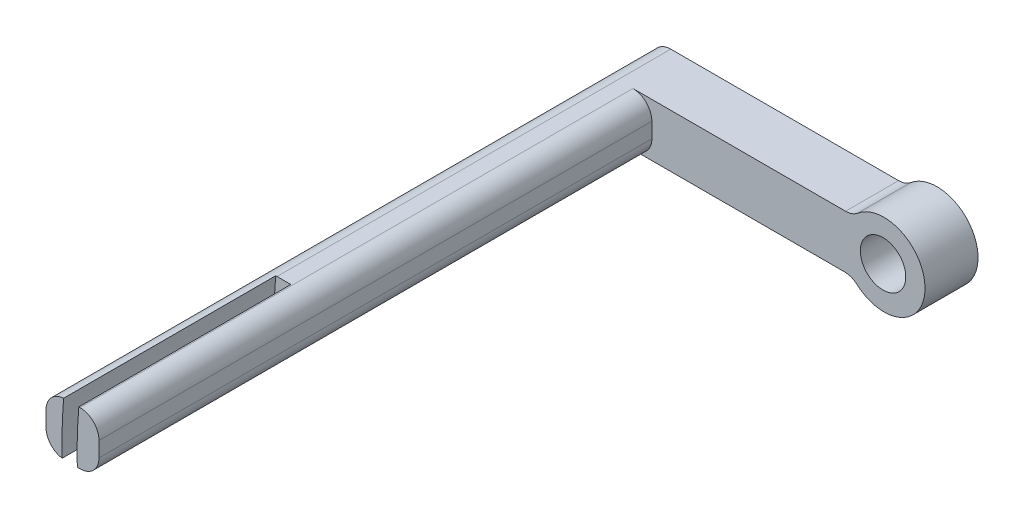
ISO-10303-21;
HEADER;
FILE_DESCRIPTION(('STEP AP214'),'2;1');
FILE_NAME('part.step','',(''),(''),'','','');
FILE_SCHEMA(('AUTOMOTIVE_DESIGN { 1 0 10303 214 1 1 1 1 }'));
ENDSEC;
DATA;
#1=APPLICATION_CONTEXT('core data for automotive mechanical design processes');
#2=APPLICATION_PROTOCOL_DEFINITION('international standard','automotive_design',2000,#1);
#3=PRODUCT_CONTEXT('',#1,'mechanical');
#4=PRODUCT('Part','Part','',(#3));
#5=PRODUCT_RELATED_PRODUCT_CATEGORY('part','',(#4));
#6=PRODUCT_DEFINITION_FORMATION('','',#4);
#7=PRODUCT_DEFINITION_CONTEXT('part definition',#1,'design');
#8=PRODUCT_DEFINITION('design','',#6,#7);
#9=PRODUCT_DEFINITION_SHAPE('','',#8);
#10=(LENGTH_UNIT() NAMED_UNIT(*) SI_UNIT(.MILLI.,.METRE.));
#11=(NAMED_UNIT(*) PLANE_ANGLE_UNIT() SI_UNIT($,.RADIAN.));
#12=(NAMED_UNIT(*) SI_UNIT($,.STERADIAN.) SOLID_ANGLE_UNIT());
#13=UNCERTAINTY_MEASURE_WITH_UNIT(LENGTH_MEASURE(1.E-05),#10,'distance_accuracy_value','');
#14=(GEOMETRIC_REPRESENTATION_CONTEXT(3) GLOBAL_UNCERTAINTY_ASSIGNED_CONTEXT((#13)) GLOBAL_UNIT_ASSIGNED_CONTEXT((#10,
#11,#12)) REPRESENTATION_CONTEXT('',''));
#15=CARTESIAN_POINT('',(0.,0.,0.));
#16=DIRECTION('',(0.,0.,1.));
#17=DIRECTION('',(1.,0.,0.));
#18=AXIS2_PLACEMENT_3D('',#15,#16,#17);
#19=CARTESIAN_POINT('',(-6.29725614319705,7.,24.804571616053));
#20=DIRECTION('',(0.,0.,-1.));
#21=DIRECTION('',(-1.,0.,0.));
#22=AXIS2_PLACEMENT_3D('',#19,#20,#21);
#23=PLANE('',#22);
#24=CARTESIAN_POINT('',(58.8086487792216,1.74301589662031,24.804571616053));
#25=DIRECTION('',(0.,0.,1.));
#26=DIRECTION('',(1.,0.,0.));
#27=AXIS2_PLACEMENT_3D('',#24,#25,#26);
#28=CIRCLE('',#27,61.);
#29=CARTESIAN_POINT('',(-1.96440543180858,7.,24.804571616053));
#30=VERTEX_POINT('',#29);
#31=CARTESIAN_POINT('',(-2.16644364042241,0.,24.804571616053));
#32=VERTEX_POINT('',#31);
#33=EDGE_CURVE('E151',#30,#32,#28,.T.);
#34=ORIENTED_EDGE('',*,*,#33,.T.);
#35=DIRECTION('',(1.,0.,0.));
#36=VECTOR('',#35,1.);
#37=CARTESIAN_POINT('',(-6.29725614319705,0.,24.804571616053));
#38=LINE('',#37,#36);
#39=CARTESIAN_POINT('',(-1.79725614319705,0.,24.804571616053));
#40=VERTEX_POINT('',#39);
#41=EDGE_CURVE('E202',#32,#40,#38,.T.);
#42=ORIENTED_EDGE('',*,*,#41,.T.);
#43=CARTESIAN_POINT('',(-1.79725614319705,2.5,24.8045716160531));
#44=DIRECTION('',(0.,0.,-1.));
#45=DIRECTION('',(-1.,0.,0.));
#46=AXIS2_PLACEMENT_3D('',#43,#44,#45);
#47=CIRCLE('',#46,2.5);
#48=CARTESIAN_POINT('',(0.70274385680295,2.5,24.804571616053));
#49=VERTEX_POINT('',#48);
#50=EDGE_CURVE('E239',#40,#49,#47,.F.);
#51=ORIENTED_EDGE('',*,*,#50,.T.);
#52=DIRECTION('',(0.,-1.,0.));
#53=VECTOR('',#52,1.);
#54=CARTESIAN_POINT('',(0.70274385680295,7.,24.804571616053));
#55=LINE('',#54,#53);
#56=CARTESIAN_POINT('',(0.70274385680295,4.5,24.804571616053));
#57=VERTEX_POINT('',#56);
#58=EDGE_CURVE('E181',#57,#49,#55,.T.);
#59=ORIENTED_EDGE('',*,*,#58,.F.);
#60=CARTESIAN_POINT('',(-1.79725614319705,4.5,24.804571616053));
#61=DIRECTION('',(0.,0.,-1.));
#62=DIRECTION('',(-1.,0.,0.));
#63=AXIS2_PLACEMENT_3D('',#60,#61,#62);
#64=CIRCLE('',#63,2.5);
#65=CARTESIAN_POINT('',(-1.79725614319705,7.,24.804571616053));
#66=VERTEX_POINT('',#65);
#67=EDGE_CURVE('E178',#57,#66,#64,.F.);
#68=ORIENTED_EDGE('',*,*,#67,.T.);
#69=DIRECTION('',(1.,0.,0.));
#70=VECTOR('',#69,1.);
#71=CARTESIAN_POINT('',(-6.29725614319705,7.,24.804571616053));
#72=LINE('',#71,#70);
#73=EDGE_CURVE('E169',#30,#66,#72,.T.);
#74=ORIENTED_EDGE('',*,*,#73,.F.);
#75=EDGE_LOOP('',(#34,#42,#51,#59,#68,#74));
#76=FACE_BOUND('',#75,.T.);
#77=ADVANCED_FACE('F39',(#76),#23,.F.);
#78=CARTESIAN_POINT('',(0.,7.,0.));
#79=DIRECTION('',(0.,1.,0.));
#80=DIRECTION('',(0.,0.,1.));
#81=AXIS2_PLACEMENT_3D('',#78,#79,#80);
#82=PLANE('',#81);
#83=DIRECTION('',(0.,0.,1.));
#84=VECTOR('',#83,1.);
#85=CARTESIAN_POINT('',(-3.79725614319705,7.,24.804571616053));
#86=LINE('',#85,#84);
#87=CARTESIAN_POINT('',(-3.79725614319706,7.,-55.195428383947));
#88=VERTEX_POINT('',#87);
#89=CARTESIAN_POINT('',(-3.79725614319705,7.,-3.19542838394696));
#90=VERTEX_POINT('',#89);
#91=EDGE_CURVE('E242',#88,#90,#86,.T.);
#92=ORIENTED_EDGE('',*,*,#91,.T.);
#93=DIRECTION('',(1.,0.,0.));
#94=VECTOR('',#93,1.);
#95=CARTESIAN_POINT('',(0.,7.,-3.19542838394696));
#96=LINE('',#95,#94);
#97=CARTESIAN_POINT('',(-1.96440543180858,7.,-3.19542838394696));
#98=VERTEX_POINT('',#97);
#99=EDGE_CURVE('E171',#90,#98,#96,.T.);
#100=ORIENTED_EDGE('',*,*,#99,.T.);
#101=DIRECTION('',(0.,0.,1.));
#102=VECTOR('',#101,1.);
#103=CARTESIAN_POINT('',(-1.96440543180858,7.,-3.19542838394696));
#104=LINE('',#103,#102);
#105=EDGE_CURVE('E155',#98,#30,#104,.T.);
#106=ORIENTED_EDGE('',*,*,#105,.T.);
#107=ORIENTED_EDGE('',*,*,#73,.T.);
#108=DIRECTION('',(0.,0.,-1.));
#109=VECTOR('',#108,1.);
#110=CARTESIAN_POINT('',(-1.79725614319706,7.,-48.195428383947));
#111=LINE('',#110,#109);
#112=CARTESIAN_POINT('',(-1.79725614319706,7.,-48.195428383947));
#113=VERTEX_POINT('',#112);
#114=EDGE_CURVE('E245',#66,#113,#111,.T.);
#115=ORIENTED_EDGE('',*,*,#114,.T.);
#116=DIRECTION('',(1.,0.,0.));
#117=VECTOR('',#116,1.);
#118=CARTESIAN_POINT('',(0.702743856802941,7.,-48.195428383947));
#119=LINE('',#118,#117);
#120=CARTESIAN_POINT('',(26.2839027131114,7.,-48.195428383947));
#121=VERTEX_POINT('',#120);
#122=EDGE_CURVE('E189',#113,#121,#119,.T.);
#123=ORIENTED_EDGE('',*,*,#122,.T.);
#124=DIRECTION('',(0.,0.,1.));
#125=VECTOR('',#124,1.);
#126=CARTESIAN_POINT('',(26.2839027131114,7.,-55.195428383947));
#127=LINE('',#126,#125);
#128=CARTESIAN_POINT('',(26.2839027131114,7.,-55.195428383947));
#129=VERTEX_POINT('',#128);
#130=EDGE_CURVE('E280',#121,#129,#127,.F.);
#131=ORIENTED_EDGE('',*,*,#130,.T.);
#132=DIRECTION('',(-1.,0.,0.));
#133=VECTOR('',#132,1.);
#134=CARTESIAN_POINT('',(0.702743856802941,7.,-55.195428383947));
#135=LINE('',#134,#133);
#136=EDGE_CURVE('E182',#129,#88,#135,.T.);
#137=ORIENTED_EDGE('',*,*,#136,.T.);
#138=EDGE_LOOP('',(#92,#100,#106,#107,#115,#123,#131,#137));
#139=FACE_BOUND('',#138,.T.);
#140=ADVANCED_FACE('F167',(#139),#82,.T.);
#141=CARTESIAN_POINT('',(0.,0.,0.));
#142=DIRECTION('',(0.,1.,0.));
#143=DIRECTION('',(0.,0.,1.));
#144=AXIS2_PLACEMENT_3D('',#141,#142,#143);
#145=PLANE('',#144);
#146=DIRECTION('',(1.,0.,0.));
#147=VECTOR('',#146,1.);
#148=CARTESIAN_POINT('',(0.,0.,-3.19542838394696));
#149=LINE('',#148,#147);
#150=CARTESIAN_POINT('',(-3.79725614319705,0.,-3.19542838394696));
#151=VERTEX_POINT('',#150);
#152=CARTESIAN_POINT('',(-2.16644364042241,0.,-3.19542838394696));
#153=VERTEX_POINT('',#152);
#154=EDGE_CURVE('E310',#151,#153,#149,.T.);
#155=ORIENTED_EDGE('',*,*,#154,.F.);
#156=DIRECTION('',(0.,0.,1.));
#157=VECTOR('',#156,1.);
#158=CARTESIAN_POINT('',(-3.79725614319705,0.,0.));
#159=LINE('',#158,#157);
#160=CARTESIAN_POINT('',(-3.79725614319706,0.,-55.195428383947));
#161=VERTEX_POINT('',#160);
#162=EDGE_CURVE('E223',#151,#161,#159,.F.);
#163=ORIENTED_EDGE('',*,*,#162,.T.);
#164=DIRECTION('',(-1.,0.,0.));
#165=VECTOR('',#164,1.);
#166=CARTESIAN_POINT('',(-6.29725614319706,0.,-55.195428383947));
#167=LINE('',#166,#165);
#168=CARTESIAN_POINT('',(26.133021239426,0.,-55.195428383947));
#169=VERTEX_POINT('',#168);
#170=EDGE_CURVE('E197',#169,#161,#167,.T.);
#171=ORIENTED_EDGE('',*,*,#170,.F.);
#172=DIRECTION('',(0.,0.,-1.));
#173=VECTOR('',#172,1.);
#174=CARTESIAN_POINT('',(26.133021239426,0.,0.));
#175=LINE('',#174,#173);
#176=CARTESIAN_POINT('',(26.133021239426,0.,-48.195428383947));
#177=VERTEX_POINT('',#176);
#178=EDGE_CURVE('E269',#169,#177,#175,.F.);
#179=ORIENTED_EDGE('',*,*,#178,.T.);
#180=DIRECTION('',(1.,0.,0.));
#181=VECTOR('',#180,1.);
#182=CARTESIAN_POINT('',(0.702743856802941,0.,-48.195428383947));
#183=LINE('',#182,#181);
#184=CARTESIAN_POINT('',(-1.79725614319706,0.,-48.195428383947));
#185=VERTEX_POINT('',#184);
#186=EDGE_CURVE('E193',#185,#177,#183,.T.);
#187=ORIENTED_EDGE('',*,*,#186,.F.);
#188=DIRECTION('',(0.,0.,-1.));
#189=VECTOR('',#188,1.);
#190=CARTESIAN_POINT('',(-1.79725614319705,0.,0.));
#191=LINE('',#190,#189);
#192=EDGE_CURVE('E226',#185,#40,#191,.F.);
#193=ORIENTED_EDGE('',*,*,#192,.T.);
#194=ORIENTED_EDGE('',*,*,#41,.F.);
#195=DIRECTION('',(0.,0.,1.));
#196=VECTOR('',#195,1.);
#197=CARTESIAN_POINT('',(-2.16644364042241,0.,-3.19542838394696));
#198=LINE('',#197,#196);
#199=EDGE_CURVE('E11',#153,#32,#198,.T.);
#200=ORIENTED_EDGE('',*,*,#199,.F.);
#201=EDGE_LOOP('',(#155,#163,#171,#179,#187,#193,#194,#200));
#202=FACE_BOUND('',#201,.T.);
#203=ADVANCED_FACE('F312',(#202),#145,.F.);
#204=CARTESIAN_POINT('',(0.702743856802941,7.,-48.195428383947));
#205=DIRECTION('',(-1.,0.,0.));
#206=DIRECTION('',(0.,0.,1.));
#207=AXIS2_PLACEMENT_3D('',#204,#205,#206);
#208=PLANE('',#207);
#209=ORIENTED_EDGE('',*,*,#58,.T.);
#210=DIRECTION('',(0.,0.,-1.));
#211=VECTOR('',#210,1.);
#212=CARTESIAN_POINT('',(0.702743856802941,2.5,-48.195428383947));
#213=LINE('',#212,#211);
#214=CARTESIAN_POINT('',(0.702743856802941,2.5,-48.195428383947));
#215=VERTEX_POINT('',#214);
#216=EDGE_CURVE('E219',#49,#215,#213,.T.);
#217=ORIENTED_EDGE('',*,*,#216,.T.);
#218=DIRECTION('',(0.,-1.,0.));
#219=VECTOR('',#218,1.);
#220=CARTESIAN_POINT('',(0.702743856802941,7.,-48.195428383947));
#221=LINE('',#220,#219);
#222=CARTESIAN_POINT('',(0.702743856802941,4.5,-48.195428383947));
#223=VERTEX_POINT('',#222);
#224=EDGE_CURVE('E212',#223,#215,#221,.T.);
#225=ORIENTED_EDGE('',*,*,#224,.F.);
#226=DIRECTION('',(0.,0.,-1.));
#227=VECTOR('',#226,1.);
#228=CARTESIAN_POINT('',(0.70274385680295,4.5,24.804571616053));
#229=LINE('',#228,#227);
#230=EDGE_CURVE('E216',#223,#57,#229,.F.);
#231=ORIENTED_EDGE('',*,*,#230,.T.);
#232=EDGE_LOOP('',(#209,#217,#225,#231));
#233=FACE_BOUND('',#232,.T.);
#234=ADVANCED_FACE('F366',(#233),#208,.F.);
#235=CARTESIAN_POINT('',(0.702743856802941,7.,-48.195428383947));
#236=DIRECTION('',(0.,0.,-1.));
#237=DIRECTION('',(-1.,0.,0.));
#238=AXIS2_PLACEMENT_3D('',#235,#236,#237);
#239=PLANE('',#238);
#240=CARTESIAN_POINT('',(31.2298948954184,3.46051657925337,-48.195428383947));
#241=DIRECTION('',(0.,0.,-1.));
#242=DIRECTION('',(-1.,0.,0.));
#243=AXIS2_PLACEMENT_3D('',#240,#241,#242);
#244=CIRCLE('',#243,3.);
#245=CARTESIAN_POINT('',(28.2298948954184,3.46051657925337,-48.195428383947));
#246=VERTEX_POINT('',#245);
#247=EDGE_CURVE('E331',#246,#246,#244,.T.);
#248=ORIENTED_EDGE('',*,*,#247,.T.);
#249=EDGE_LOOP('',(#248));
#250=FACE_BOUND('',#249,.T.);
#251=ORIENTED_EDGE('',*,*,#186,.T.);
#252=CARTESIAN_POINT('',(26.133021239426,-2.5,-48.195428383947));
#253=DIRECTION('',(0.,0.,-1.));
#254=DIRECTION('',(-1.,0.,0.));
#255=AXIS2_PLACEMENT_3D('',#252,#253,#254);
#256=CIRCLE('',#255,2.5);
#257=CARTESIAN_POINT('',(27.7857974676817,-0.624278608291504,-48.195428383947));
#258=VERTEX_POINT('',#257);
#259=EDGE_CURVE('E283',#177,#258,#256,.T.);
#260=ORIENTED_EDGE('',*,*,#259,.T.);
#261=CARTESIAN_POINT('',(31.3627665763609,3.43519257717622,-48.195428383947));
#262=DIRECTION('',(0.,0.,-1.));
#263=DIRECTION('',(-1.,0.,0.));
#264=AXIS2_PLACEMENT_3D('',#261,#262,#263);
#265=CIRCLE('',#264,5.41054658145439);
#266=CARTESIAN_POINT('',(27.8889952977239,7.58331593766156,-48.195428383947));
#267=VERTEX_POINT('',#266);
#268=EDGE_CURVE('E198',#267,#258,#265,.T.);
#269=ORIENTED_EDGE('',*,*,#268,.F.);
#270=CARTESIAN_POINT('',(26.2839027131114,9.5,-48.195428383947));
#271=DIRECTION('',(0.,0.,-1.));
#272=DIRECTION('',(-1.,0.,0.));
#273=AXIS2_PLACEMENT_3D('',#270,#271,#272);
#274=CIRCLE('',#273,2.5);
#275=EDGE_CURVE('E63',#267,#121,#274,.T.);
#276=ORIENTED_EDGE('',*,*,#275,.T.);
#277=ORIENTED_EDGE('',*,*,#122,.F.);
#278=CARTESIAN_POINT('',(-1.79725614319706,4.5,-48.195428383947));
#279=DIRECTION('',(0.,0.,-1.));
#280=DIRECTION('',(-1.,0.,0.));
#281=AXIS2_PLACEMENT_3D('',#278,#279,#280);
#282=CIRCLE('',#281,2.5);
#283=EDGE_CURVE('E266',#113,#223,#282,.T.);
#284=ORIENTED_EDGE('',*,*,#283,.T.);
#285=ORIENTED_EDGE('',*,*,#224,.T.);
#286=CARTESIAN_POINT('',(-1.79725614319706,2.5,-48.195428383947));
#287=DIRECTION('',(0.,0.,-1.));
#288=DIRECTION('',(-1.,0.,0.));
#289=AXIS2_PLACEMENT_3D('',#286,#287,#288);
#290=CIRCLE('',#289,2.5);
#291=EDGE_CURVE('E262',#215,#185,#290,.T.);
#292=ORIENTED_EDGE('',*,*,#291,.T.);
#293=EDGE_LOOP('',(#251,#260,#269,#276,#277,#284,#285,#292));
#294=FACE_BOUND('',#293,.T.);
#295=ADVANCED_FACE('F358',(#250,#294),#239,.F.);
#296=CARTESIAN_POINT('',(-6.29725614319706,7.,-55.195428383947));
#297=DIRECTION('',(0.,0.,1.));
#298=DIRECTION('',(1.,0.,0.));
#299=AXIS2_PLACEMENT_3D('',#296,#297,#298);
#300=PLANE('',#299);
#301=CARTESIAN_POINT('',(31.2298948954184,3.46051657925337,-55.195428383947));
#302=DIRECTION('',(0.,0.,-1.));
#303=DIRECTION('',(-1.,0.,0.));
#304=AXIS2_PLACEMENT_3D('',#301,#302,#303);
#305=CIRCLE('',#304,3.);
#306=CARTESIAN_POINT('',(28.2298948954184,3.46051657925337,-55.195428383947));
#307=VERTEX_POINT('',#306);
#308=EDGE_CURVE('E173',#307,#307,#305,.T.);
#309=ORIENTED_EDGE('',*,*,#308,.F.);
#310=EDGE_LOOP('',(#309));
#311=FACE_BOUND('',#310,.T.);
#312=ORIENTED_EDGE('',*,*,#136,.F.);
#313=CARTESIAN_POINT('',(26.2839027131114,9.5,-55.195428383947));
#314=DIRECTION('',(0.,0.,1.));
#315=DIRECTION('',(1.,0.,0.));
#316=AXIS2_PLACEMENT_3D('',#313,#314,#315);
#317=CIRCLE('',#316,2.5);
#318=CARTESIAN_POINT('',(27.8889952977239,7.58331593766156,-55.195428383947));
#319=VERTEX_POINT('',#318);
#320=EDGE_CURVE('E291',#129,#319,#317,.T.);
#321=ORIENTED_EDGE('',*,*,#320,.T.);
#322=CARTESIAN_POINT('',(31.3627665763609,3.43519257717622,-55.195428383947));
#323=DIRECTION('',(0.,0.,-1.));
#324=DIRECTION('',(-1.,0.,0.));
#325=AXIS2_PLACEMENT_3D('',#322,#323,#324);
#326=CIRCLE('',#325,5.41054658145439);
#327=CARTESIAN_POINT('',(27.7857974676817,-0.624278608291504,-55.195428383947));
#328=VERTEX_POINT('',#327);
#329=EDGE_CURVE('E335',#319,#328,#326,.T.);
#330=ORIENTED_EDGE('',*,*,#329,.T.);
#331=CARTESIAN_POINT('',(26.133021239426,-2.5,-55.195428383947));
#332=DIRECTION('',(0.,0.,1.));
#333=DIRECTION('',(1.,0.,0.));
#334=AXIS2_PLACEMENT_3D('',#331,#332,#333);
#335=CIRCLE('',#334,2.5);
#336=EDGE_CURVE('E286',#328,#169,#335,.T.);
#337=ORIENTED_EDGE('',*,*,#336,.T.);
#338=ORIENTED_EDGE('',*,*,#170,.T.);
#339=CARTESIAN_POINT('',(-3.79725614319706,2.5,-55.195428383947));
#340=DIRECTION('',(0.,0.,1.));
#341=DIRECTION('',(1.,0.,0.));
#342=AXIS2_PLACEMENT_3D('',#339,#340,#341);
#343=CIRCLE('',#342,2.5);
#344=CARTESIAN_POINT('',(-6.29725614319706,2.5,-55.195428383947));
#345=VERTEX_POINT('',#344);
#346=EDGE_CURVE('E255',#161,#345,#343,.F.);
#347=ORIENTED_EDGE('',*,*,#346,.T.);
#348=DIRECTION('',(0.,-1.,0.));
#349=VECTOR('',#348,1.);
#350=CARTESIAN_POINT('',(-6.29725614319706,7.,-55.195428383947));
#351=LINE('',#350,#349);
#352=CARTESIAN_POINT('',(-6.29725614319706,4.5,-55.195428383947));
#353=VERTEX_POINT('',#352);
#354=EDGE_CURVE('E208',#353,#345,#351,.T.);
#355=ORIENTED_EDGE('',*,*,#354,.F.);
#356=CARTESIAN_POINT('',(-3.79725614319706,4.5,-55.195428383947));
#357=DIRECTION('',(0.,0.,1.));
#358=DIRECTION('',(1.,0.,0.));
#359=AXIS2_PLACEMENT_3D('',#356,#357,#358);
#360=CIRCLE('',#359,2.5);
#361=EDGE_CURVE('E258',#353,#88,#360,.F.);
#362=ORIENTED_EDGE('',*,*,#361,.T.);
#363=EDGE_LOOP('',(#312,#321,#330,#337,#338,#347,#355,#362));
#364=FACE_BOUND('',#363,.T.);
#365=ADVANCED_FACE('F350',(#311,#364),#300,.F.);
#366=CARTESIAN_POINT('',(-6.29725614319706,7.,-55.195428383947));
#367=DIRECTION('',(1.,0.,0.));
#368=DIRECTION('',(0.,0.,-1.));
#369=AXIS2_PLACEMENT_3D('',#366,#367,#368);
#370=PLANE('',#369);
#371=DIRECTION('',(0.,-1.,0.));
#372=VECTOR('',#371,1.);
#373=CARTESIAN_POINT('',(-6.29725614319705,7.,24.804571616053));
#374=LINE('',#373,#372);
#375=CARTESIAN_POINT('',(-6.29725614319705,4.5,24.804571616053));
#376=VERTEX_POINT('',#375);
#377=CARTESIAN_POINT('',(-6.29725614319705,2.5,24.804571616053));
#378=VERTEX_POINT('',#377);
#379=EDGE_CURVE('E187',#376,#378,#374,.T.);
#380=ORIENTED_EDGE('',*,*,#379,.F.);
#381=DIRECTION('',(0.,0.,1.));
#382=VECTOR('',#381,1.);
#383=CARTESIAN_POINT('',(-6.29725614319706,4.5,-55.195428383947));
#384=LINE('',#383,#382);
#385=EDGE_CURVE('E252',#376,#353,#384,.F.);
#386=ORIENTED_EDGE('',*,*,#385,.T.);
#387=ORIENTED_EDGE('',*,*,#354,.T.);
#388=DIRECTION('',(0.,0.,1.));
#389=VECTOR('',#388,1.);
#390=CARTESIAN_POINT('',(-6.29725614319706,2.5,-55.195428383947));
#391=LINE('',#390,#389);
#392=EDGE_CURVE('E248',#345,#378,#391,.T.);
#393=ORIENTED_EDGE('',*,*,#392,.T.);
#394=EDGE_LOOP('',(#380,#386,#387,#393));
#395=FACE_BOUND('',#394,.T.);
#396=ADVANCED_FACE('F390',(#395),#370,.F.);
#397=CARTESIAN_POINT('',(-3.79725614319705,2.5,24.804571616053));
#398=DIRECTION('',(0.,0.,-1.));
#399=DIRECTION('',(-1.,0.,0.));
#400=AXIS2_PLACEMENT_3D('',#397,#398,#399);
#401=CIRCLE('',#400,2.5);
#402=CARTESIAN_POINT('',(-4.16799365797037,0.0276420778655508,24.804571616053));
#403=VERTEX_POINT('',#402);
#404=EDGE_CURVE('E230',#378,#403,#401,.F.);
#405=ORIENTED_EDGE('',*,*,#404,.T.);
#406=CARTESIAN_POINT('',(58.8086487792216,1.74301589662031,24.804571616053));
#407=DIRECTION('',(0.,0.,1.));
#408=DIRECTION('',(1.,0.,0.));
#409=AXIS2_PLACEMENT_3D('',#406,#407,#408);
#410=CIRCLE('',#409,63.);
#411=CARTESIAN_POINT('',(-3.97214827048142,6.99387504575003,24.804571616053));
#412=VERTEX_POINT('',#411);
#413=EDGE_CURVE('E303',#412,#403,#410,.T.);
#414=ORIENTED_EDGE('',*,*,#413,.F.);
#415=CARTESIAN_POINT('',(-3.79725614319705,4.5,24.804571616053));
#416=DIRECTION('',(0.,0.,-1.));
#417=DIRECTION('',(-1.,0.,0.));
#418=AXIS2_PLACEMENT_3D('',#415,#416,#417);
#419=CIRCLE('',#418,2.5);
#420=EDGE_CURVE('E234',#412,#376,#419,.F.);
#421=ORIENTED_EDGE('',*,*,#420,.T.);
#422=ORIENTED_EDGE('',*,*,#379,.T.);
#423=EDGE_LOOP('',(#405,#414,#421,#422));
#424=FACE_BOUND('',#423,.T.);
#425=ADVANCED_FACE('F379',(#424),#23,.F.);
#426=CARTESIAN_POINT('',(-1.79725614319706,2.5,-48.195428383947));
#427=DIRECTION('',(0.,0.,-1.));
#428=DIRECTION('',(-1.,0.,0.));
#429=AXIS2_PLACEMENT_3D('',#426,#427,#428);
#430=CYLINDRICAL_SURFACE('',#429,2.5);
#431=ORIENTED_EDGE('',*,*,#50,.F.);
#432=ORIENTED_EDGE('',*,*,#192,.F.);
#433=ORIENTED_EDGE('',*,*,#291,.F.);
#434=ORIENTED_EDGE('',*,*,#216,.F.);
#435=EDGE_LOOP('',(#431,#432,#433,#434));
#436=FACE_BOUND('',#435,.T.);
#437=ADVANCED_FACE('F364',(#436),#430,.T.);
#438=CARTESIAN_POINT('',(-1.79725614319705,4.5,0.));
#439=DIRECTION('',(0.,0.,1.));
#440=DIRECTION('',(1.,0.,0.));
#441=AXIS2_PLACEMENT_3D('',#438,#439,#440);
#442=CYLINDRICAL_SURFACE('',#441,2.5);
#443=ORIENTED_EDGE('',*,*,#67,.F.);
#444=ORIENTED_EDGE('',*,*,#230,.F.);
#445=ORIENTED_EDGE('',*,*,#283,.F.);
#446=ORIENTED_EDGE('',*,*,#114,.F.);
#447=EDGE_LOOP('',(#443,#444,#445,#446));
#448=FACE_BOUND('',#447,.T.);
#449=ADVANCED_FACE('F369',(#448),#442,.T.);
#450=CARTESIAN_POINT('',(-3.79725614319705,4.5,0.));
#451=DIRECTION('',(0.,0.,-1.));
#452=DIRECTION('',(-1.,0.,0.));
#453=AXIS2_PLACEMENT_3D('',#450,#451,#452);
#454=CYLINDRICAL_SURFACE('',#453,2.5);
#455=DIRECTION('',(0.,0.,1.));
#456=VECTOR('',#455,1.);
#457=CARTESIAN_POINT('',(-3.97214827048144,6.99387504574988,10.804571616053));
#458=LINE('',#457,#456);
#459=CARTESIAN_POINT('',(-3.97214827048142,6.99387504575003,-3.19542838394696));
#460=VERTEX_POINT('',#459);
#461=EDGE_CURVE('E174',#460,#412,#458,.T.);
#462=ORIENTED_EDGE('',*,*,#461,.F.);
#463=CARTESIAN_POINT('',(-3.79725614319705,4.5,-3.19542838394696));
#464=DIRECTION('',(0.,0.,1.));
#465=DIRECTION('',(1.,0.,0.));
#466=AXIS2_PLACEMENT_3D('',#463,#464,#465);
#467=CIRCLE('',#466,2.5);
#468=EDGE_CURVE('E315',#460,#90,#467,.F.);
#469=ORIENTED_EDGE('',*,*,#468,.T.);
#470=ORIENTED_EDGE('',*,*,#91,.F.);
#471=ORIENTED_EDGE('',*,*,#361,.F.);
#472=ORIENTED_EDGE('',*,*,#385,.F.);
#473=ORIENTED_EDGE('',*,*,#420,.F.);
#474=EDGE_LOOP('',(#462,#469,#470,#471,#472,#473));
#475=FACE_BOUND('',#474,.T.);
#476=ADVANCED_FACE('F371',(#475),#454,.T.);
#477=CARTESIAN_POINT('',(-3.79725614319706,2.5,-55.195428383947));
#478=DIRECTION('',(0.,0.,1.));
#479=DIRECTION('',(1.,0.,0.));
#480=AXIS2_PLACEMENT_3D('',#477,#478,#479);
#481=CYLINDRICAL_SURFACE('',#480,2.5);
#482=DIRECTION('',(0.,0.,1.));
#483=VECTOR('',#482,1.);
#484=CARTESIAN_POINT('',(-4.16799365797038,0.0276420778658085,10.804571616053));
#485=LINE('',#484,#483);
#486=CARTESIAN_POINT('',(-4.16799365797037,0.0276420778655508,-3.19542838394696));
#487=VERTEX_POINT('',#486);
#488=EDGE_CURVE('E48',#403,#487,#485,.F.);
#489=ORIENTED_EDGE('',*,*,#488,.F.);
#490=ORIENTED_EDGE('',*,*,#404,.F.);
#491=ORIENTED_EDGE('',*,*,#392,.F.);
#492=ORIENTED_EDGE('',*,*,#346,.F.);
#493=ORIENTED_EDGE('',*,*,#162,.F.);
#494=CARTESIAN_POINT('',(-3.79725614319705,2.5,-3.19542838394696));
#495=DIRECTION('',(0.,0.,1.));
#496=DIRECTION('',(1.,0.,0.));
#497=AXIS2_PLACEMENT_3D('',#494,#495,#496);
#498=CIRCLE('',#497,2.5);
#499=EDGE_CURVE('E294',#151,#487,#498,.F.);
#500=ORIENTED_EDGE('',*,*,#499,.T.);
#501=EDGE_LOOP('',(#489,#490,#491,#492,#493,#500));
#502=FACE_BOUND('',#501,.T.);
#503=ADVANCED_FACE('F306',(#502),#481,.T.);
#504=CARTESIAN_POINT('',(31.3627665763609,3.43519257717622,-48.195428383947));
#505=DIRECTION('',(0.,0.,-1.));
#506=DIRECTION('',(-1.,0.,0.));
#507=AXIS2_PLACEMENT_3D('',#504,#505,#506);
#508=CYLINDRICAL_SURFACE('',#507,5.41054658145439);
#509=ORIENTED_EDGE('',*,*,#268,.T.);
#510=DIRECTION('',(0.,0.,-1.));
#511=VECTOR('',#510,1.);
#512=CARTESIAN_POINT('',(27.7857974676817,-0.624278608291503,-48.195428383947));
#513=LINE('',#512,#511);
#514=EDGE_CURVE('E277',#258,#328,#513,.T.);
#515=ORIENTED_EDGE('',*,*,#514,.T.);
#516=ORIENTED_EDGE('',*,*,#329,.F.);
#517=DIRECTION('',(0.,0.,-1.));
#518=VECTOR('',#517,1.);
#519=CARTESIAN_POINT('',(27.8889952977239,7.58331593766156,-48.195428383947));
#520=LINE('',#519,#518);
#521=EDGE_CURVE('E273',#319,#267,#520,.F.);
#522=ORIENTED_EDGE('',*,*,#521,.T.);
#523=EDGE_LOOP('',(#509,#515,#516,#522));
#524=FACE_BOUND('',#523,.T.);
#525=ADVANCED_FACE('F353',(#524),#508,.T.);
#526=CARTESIAN_POINT('',(26.133021239426,-2.5,-48.195428383947));
#527=DIRECTION('',(0.,0.,-1.));
#528=DIRECTION('',(-1.,0.,0.));
#529=AXIS2_PLACEMENT_3D('',#526,#527,#528);
#530=CYLINDRICAL_SURFACE('',#529,2.5);
#531=ORIENTED_EDGE('',*,*,#336,.F.);
#532=ORIENTED_EDGE('',*,*,#514,.F.);
#533=ORIENTED_EDGE('',*,*,#259,.F.);
#534=ORIENTED_EDGE('',*,*,#178,.F.);
#535=EDGE_LOOP('',(#531,#532,#533,#534));
#536=FACE_BOUND('',#535,.T.);
#537=ADVANCED_FACE('F356',(#536),#530,.F.);
#538=CARTESIAN_POINT('',(26.2839027131114,9.5,-48.195428383947));
#539=DIRECTION('',(0.,0.,-1.));
#540=DIRECTION('',(-1.,0.,0.));
#541=AXIS2_PLACEMENT_3D('',#538,#539,#540);
#542=CYLINDRICAL_SURFACE('',#541,2.5);
#543=ORIENTED_EDGE('',*,*,#320,.F.);
#544=ORIENTED_EDGE('',*,*,#130,.F.);
#545=ORIENTED_EDGE('',*,*,#275,.F.);
#546=ORIENTED_EDGE('',*,*,#521,.F.);
#547=EDGE_LOOP('',(#543,#544,#545,#546));
#548=FACE_BOUND('',#547,.T.);
#549=ADVANCED_FACE('F41',(#548),#542,.F.);
#550=CARTESIAN_POINT('',(31.2298948954184,3.46051657925337,-39.195428383947));
#551=DIRECTION('',(0.,0.,-1.));
#552=DIRECTION('',(-1.,0.,0.));
#553=AXIS2_PLACEMENT_3D('',#550,#551,#552);
#554=CYLINDRICAL_SURFACE('',#553,3.);
#555=ORIENTED_EDGE('',*,*,#308,.T.);
#556=EDGE_LOOP('',(#555));
#557=FACE_BOUND('',#556,.T.);
#558=ORIENTED_EDGE('',*,*,#247,.F.);
#559=EDGE_LOOP('',(#558));
#560=FACE_BOUND('',#559,.T.);
#561=ADVANCED_FACE('F424',(#557,#560),#554,.F.);
#562=CARTESIAN_POINT('',(58.8086487792216,1.74301589662031,-3.19542838394696));
#563=DIRECTION('',(0.,0.,1.));
#564=DIRECTION('',(1.,0.,0.));
#565=AXIS2_PLACEMENT_3D('',#562,#563,#564);
#566=CYLINDRICAL_SURFACE('',#565,63.);
#567=ORIENTED_EDGE('',*,*,#461,.T.);
#568=ORIENTED_EDGE('',*,*,#413,.T.);
#569=ORIENTED_EDGE('',*,*,#488,.T.);
#570=CARTESIAN_POINT('',(58.8086487792216,1.74301589662031,-3.19542838394696));
#571=DIRECTION('',(0.,0.,1.));
#572=DIRECTION('',(1.,0.,0.));
#573=AXIS2_PLACEMENT_3D('',#570,#571,#572);
#574=CIRCLE('',#573,63.);
#575=EDGE_CURVE('E55',#460,#487,#574,.T.);
#576=ORIENTED_EDGE('',*,*,#575,.F.);
#577=EDGE_LOOP('',(#567,#568,#569,#576));
#578=FACE_BOUND('',#577,.T.);
#579=ADVANCED_FACE('F300',(#578),#566,.F.);
#580=CARTESIAN_POINT('',(58.8086487792216,1.74301589662031,-3.19542838394696));
#581=DIRECTION('',(0.,0.,1.));
#582=DIRECTION('',(1.,0.,0.));
#583=AXIS2_PLACEMENT_3D('',#580,#581,#582);
#584=PLANE('',#583);
#585=ORIENTED_EDGE('',*,*,#468,.F.);
#586=ORIENTED_EDGE('',*,*,#575,.T.);
#587=ORIENTED_EDGE('',*,*,#499,.F.);
#588=ORIENTED_EDGE('',*,*,#154,.T.);
#589=CARTESIAN_POINT('',(58.8086487792216,1.74301589662031,-3.19542838394696));
#590=DIRECTION('',(0.,0.,1.));
#591=DIRECTION('',(1.,0.,0.));
#592=AXIS2_PLACEMENT_3D('',#589,#590,#591);
#593=CIRCLE('',#592,61.);
#594=EDGE_CURVE('E162',#98,#153,#593,.T.);
#595=ORIENTED_EDGE('',*,*,#594,.F.);
#596=ORIENTED_EDGE('',*,*,#99,.F.);
#597=EDGE_LOOP('',(#585,#586,#587,#588,#595,#596));
#598=FACE_BOUND('',#597,.T.);
#599=ADVANCED_FACE('F309',(#598),#584,.T.);
#600=CARTESIAN_POINT('',(58.8086487792216,1.74301589662031,-3.19542838394696));
#601=DIRECTION('',(0.,0.,1.));
#602=DIRECTION('',(1.,0.,0.));
#603=AXIS2_PLACEMENT_3D('',#600,#601,#602);
#604=CYLINDRICAL_SURFACE('',#603,61.);
#605=ORIENTED_EDGE('',*,*,#594,.T.);
#606=ORIENTED_EDGE('',*,*,#199,.T.);
#607=ORIENTED_EDGE('',*,*,#33,.F.);
#608=ORIENTED_EDGE('',*,*,#105,.F.);
#609=EDGE_LOOP('',(#605,#606,#607,#608));
#610=FACE_BOUND('',#609,.T.);
#611=ADVANCED_FACE('F154',(#610),#604,.T.);
#612=CLOSED_SHELL('',(#77,#140,#203,#234,#295,#365,#396,#425,#437,#449,#476,#503,#525,#537,#549,
#561,#579,#599,#611));
#613=MANIFOLD_SOLID_BREP('B2',#612);
#614=ADVANCED_BREP_SHAPE_REPRESENTATION('',(#18,#613),#14);
#615=SHAPE_DEFINITION_REPRESENTATION(#9,#614);
ENDSEC;
END-ISO-10303-21;
